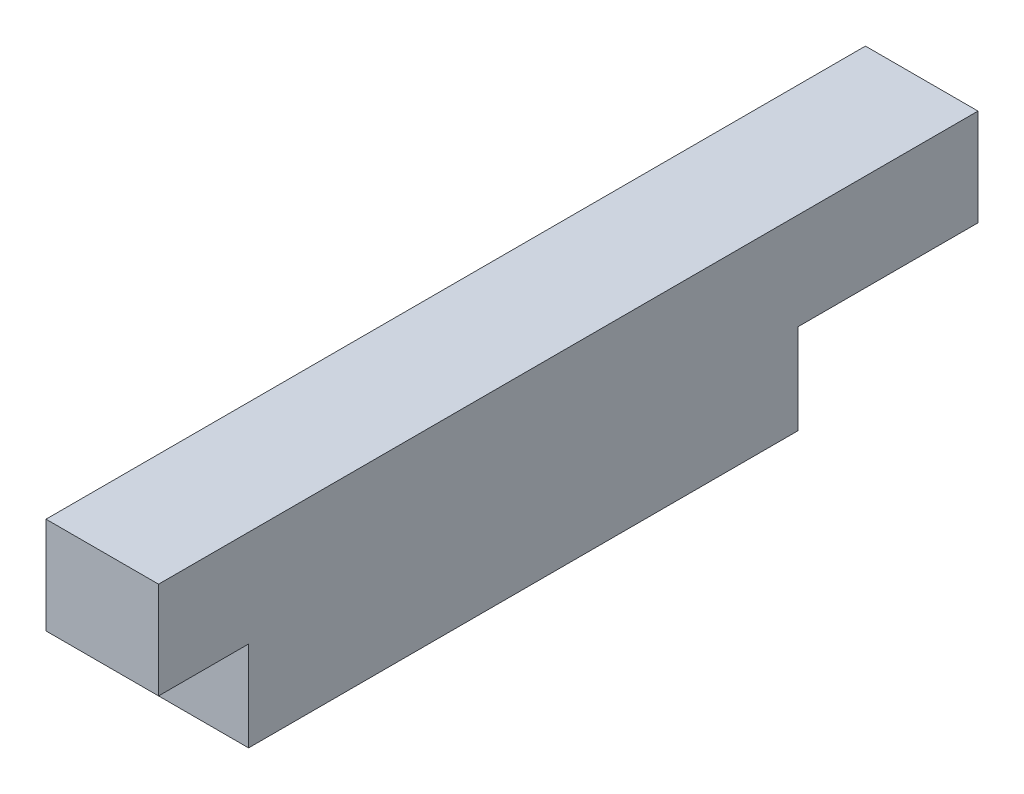
ISO-10303-21;
HEADER;
FILE_DESCRIPTION(('STEP AP214'),'2;1');
FILE_NAME('part.step','',(''),(''),'','','');
FILE_SCHEMA(('AUTOMOTIVE_DESIGN { 1 0 10303 214 1 1 1 1 }'));
ENDSEC;
DATA;
#1=APPLICATION_CONTEXT('core data for automotive mechanical design processes');
#2=APPLICATION_PROTOCOL_DEFINITION('international standard','automotive_design',2000,#1);
#3=PRODUCT_CONTEXT('',#1,'mechanical');
#4=PRODUCT('Part','Part','',(#3));
#5=PRODUCT_RELATED_PRODUCT_CATEGORY('part','',(#4));
#6=PRODUCT_DEFINITION_FORMATION('','',#4);
#7=PRODUCT_DEFINITION_CONTEXT('part definition',#1,'design');
#8=PRODUCT_DEFINITION('design','',#6,#7);
#9=PRODUCT_DEFINITION_SHAPE('','',#8);
#10=(LENGTH_UNIT() NAMED_UNIT(*) SI_UNIT(.MILLI.,.METRE.));
#11=(NAMED_UNIT(*) PLANE_ANGLE_UNIT() SI_UNIT($,.RADIAN.));
#12=(NAMED_UNIT(*) SI_UNIT($,.STERADIAN.) SOLID_ANGLE_UNIT());
#13=UNCERTAINTY_MEASURE_WITH_UNIT(LENGTH_MEASURE(1.E-05),#10,'distance_accuracy_value','');
#14=(GEOMETRIC_REPRESENTATION_CONTEXT(3) GLOBAL_UNCERTAINTY_ASSIGNED_CONTEXT((#13)) GLOBAL_UNIT_ASSIGNED_CONTEXT((#10,
#11,#12)) REPRESENTATION_CONTEXT('',''));
#15=CARTESIAN_POINT('',(0.,0.,0.));
#16=DIRECTION('',(0.,0.,1.));
#17=DIRECTION('',(1.,0.,0.));
#18=AXIS2_PLACEMENT_3D('',#15,#16,#17);
#19=CARTESIAN_POINT('',(5.,4.,-4.));
#20=DIRECTION('',(0.,1.,0.));
#21=DIRECTION('',(0.,0.,1.));
#22=AXIS2_PLACEMENT_3D('',#19,#20,#21);
#23=PLANE('',#22);
#24=DIRECTION('',(0.,0.,-1.));
#25=VECTOR('',#24,1.);
#26=CARTESIAN_POINT('',(0.,4.,-4.));
#27=LINE('',#26,#25);
#28=CARTESIAN_POINT('',(0.,4.,0.));
#29=VERTEX_POINT('',#28);
#30=CARTESIAN_POINT('',(0.,4.,-4.));
#31=VERTEX_POINT('',#30);
#32=EDGE_CURVE('E129',#29,#31,#27,.T.);
#33=ORIENTED_EDGE('',*,*,#32,.T.);
#34=DIRECTION('',(-1.,0.,0.));
#35=VECTOR('',#34,1.);
#36=CARTESIAN_POINT('',(5.,4.,-4.));
#37=LINE('',#36,#35);
#38=CARTESIAN_POINT('',(5.,4.,-4.));
#39=VERTEX_POINT('',#38);
#40=EDGE_CURVE('E11',#39,#31,#37,.T.);
#41=ORIENTED_EDGE('',*,*,#40,.F.);
#42=DIRECTION('',(0.,0.,-1.));
#43=VECTOR('',#42,1.);
#44=CARTESIAN_POINT('',(5.,4.,-4.));
#45=LINE('',#44,#43);
#46=CARTESIAN_POINT('',(5.,4.,0.));
#47=VERTEX_POINT('',#46);
#48=EDGE_CURVE('E144',#47,#39,#45,.T.);
#49=ORIENTED_EDGE('',*,*,#48,.F.);
#50=DIRECTION('',(-1.,0.,0.));
#51=VECTOR('',#50,1.);
#52=CARTESIAN_POINT('',(5.,4.,0.));
#53=LINE('',#52,#51);
#54=EDGE_CURVE('E125',#47,#29,#53,.T.);
#55=ORIENTED_EDGE('',*,*,#54,.T.);
#56=EDGE_LOOP('',(#33,#41,#49,#55));
#57=FACE_BOUND('',#56,.T.);
#58=ADVANCED_FACE('F33',(#57),#23,.F.);
#59=CARTESIAN_POINT('',(5.,0.,-4.));
#60=DIRECTION('',(0.,0.,-1.));
#61=DIRECTION('',(0.,1.,0.));
#62=AXIS2_PLACEMENT_3D('',#59,#60,#61);
#63=PLANE('',#62);
#64=DIRECTION('',(0.,-1.,0.));
#65=VECTOR('',#64,1.);
#66=CARTESIAN_POINT('',(0.,0.,-4.));
#67=LINE('',#66,#65);
#68=CARTESIAN_POINT('',(0.,0.,-4.));
#69=VERTEX_POINT('',#68);
#70=EDGE_CURVE('E132',#31,#69,#67,.T.);
#71=ORIENTED_EDGE('',*,*,#70,.T.);
#72=DIRECTION('',(-1.,0.,0.));
#73=VECTOR('',#72,1.);
#74=CARTESIAN_POINT('',(5.,0.,-4.));
#75=LINE('',#74,#73);
#76=CARTESIAN_POINT('',(5.,0.,-4.));
#77=VERTEX_POINT('',#76);
#78=EDGE_CURVE('E41',#77,#69,#75,.T.);
#79=ORIENTED_EDGE('',*,*,#78,.F.);
#80=DIRECTION('',(0.,-1.,0.));
#81=VECTOR('',#80,1.);
#82=CARTESIAN_POINT('',(5.,0.,-4.));
#83=LINE('',#82,#81);
#84=EDGE_CURVE('E92',#39,#77,#83,.T.);
#85=ORIENTED_EDGE('',*,*,#84,.F.);
#86=ORIENTED_EDGE('',*,*,#40,.T.);
#87=EDGE_LOOP('',(#71,#79,#85,#86));
#88=FACE_BOUND('',#87,.T.);
#89=ADVANCED_FACE('F193',(#88),#63,.F.);
#90=CARTESIAN_POINT('',(5.,0.,-28.4));
#91=DIRECTION('',(0.,1.,0.));
#92=DIRECTION('',(0.,0.,1.));
#93=AXIS2_PLACEMENT_3D('',#90,#91,#92);
#94=PLANE('',#93);
#95=CARTESIAN_POINT('',(2.5,0.,-9.));
#96=DIRECTION('',(0.,-1.,0.));
#97=DIRECTION('',(0.,0.,-1.));
#98=AXIS2_PLACEMENT_3D('',#95,#96,#97);
#99=CIRCLE('',#98,0.799999999999999);
#100=CARTESIAN_POINT('',(2.5,0.,-9.8));
#101=VERTEX_POINT('',#100);
#102=EDGE_CURVE('E185',#101,#101,#99,.T.);
#103=ORIENTED_EDGE('',*,*,#102,.F.);
#104=EDGE_LOOP('',(#103));
#105=FACE_BOUND('',#104,.T.);
#106=CARTESIAN_POINT('',(2.5,0.,-23.4));
#107=DIRECTION('',(0.,-1.,0.));
#108=DIRECTION('',(0.,0.,-1.));
#109=AXIS2_PLACEMENT_3D('',#106,#107,#108);
#110=CIRCLE('',#109,0.799999999999999);
#111=CARTESIAN_POINT('',(2.5,0.,-24.2));
#112=VERTEX_POINT('',#111);
#113=EDGE_CURVE('E179',#112,#112,#110,.T.);
#114=ORIENTED_EDGE('',*,*,#113,.F.);
#115=EDGE_LOOP('',(#114));
#116=FACE_BOUND('',#115,.T.);
#117=DIRECTION('',(0.,0.,-1.));
#118=VECTOR('',#117,1.);
#119=CARTESIAN_POINT('',(0.,0.,-28.4));
#120=LINE('',#119,#118);
#121=CARTESIAN_POINT('',(0.,0.,-28.4));
#122=VERTEX_POINT('',#121);
#123=EDGE_CURVE('E135',#69,#122,#120,.T.);
#124=ORIENTED_EDGE('',*,*,#123,.T.);
#125=DIRECTION('',(-1.,0.,0.));
#126=VECTOR('',#125,1.);
#127=CARTESIAN_POINT('',(5.,0.,-28.4));
#128=LINE('',#127,#126);
#129=CARTESIAN_POINT('',(5.,0.,-28.4));
#130=VERTEX_POINT('',#129);
#131=EDGE_CURVE('E151',#130,#122,#128,.T.);
#132=ORIENTED_EDGE('',*,*,#131,.F.);
#133=DIRECTION('',(0.,0.,-1.));
#134=VECTOR('',#133,1.);
#135=CARTESIAN_POINT('',(5.,0.,-28.4));
#136=LINE('',#135,#134);
#137=EDGE_CURVE('E159',#77,#130,#136,.T.);
#138=ORIENTED_EDGE('',*,*,#137,.F.);
#139=ORIENTED_EDGE('',*,*,#78,.T.);
#140=EDGE_LOOP('',(#124,#132,#138,#139));
#141=FACE_BOUND('',#140,.T.);
#142=ADVANCED_FACE('F157',(#105,#116,#141),#94,.F.);
#143=CARTESIAN_POINT('',(5.,4.,-28.4));
#144=DIRECTION('',(0.,0.,1.));
#145=DIRECTION('',(1.,0.,0.));
#146=AXIS2_PLACEMENT_3D('',#143,#144,#145);
#147=PLANE('',#146);
#148=DIRECTION('',(0.,1.,0.));
#149=VECTOR('',#148,1.);
#150=CARTESIAN_POINT('',(0.,4.,-28.4));
#151=LINE('',#150,#149);
#152=CARTESIAN_POINT('',(0.,4.,-28.4));
#153=VERTEX_POINT('',#152);
#154=EDGE_CURVE('E137',#122,#153,#151,.T.);
#155=ORIENTED_EDGE('',*,*,#154,.T.);
#156=DIRECTION('',(-1.,0.,0.));
#157=VECTOR('',#156,1.);
#158=CARTESIAN_POINT('',(5.,4.,-28.4));
#159=LINE('',#158,#157);
#160=CARTESIAN_POINT('',(5.,4.,-28.4));
#161=VERTEX_POINT('',#160);
#162=EDGE_CURVE('E148',#161,#153,#159,.T.);
#163=ORIENTED_EDGE('',*,*,#162,.F.);
#164=DIRECTION('',(0.,1.,0.));
#165=VECTOR('',#164,1.);
#166=CARTESIAN_POINT('',(5.,4.,-28.4));
#167=LINE('',#166,#165);
#168=EDGE_CURVE('E171',#130,#161,#167,.T.);
#169=ORIENTED_EDGE('',*,*,#168,.F.);
#170=ORIENTED_EDGE('',*,*,#131,.T.);
#171=EDGE_LOOP('',(#155,#163,#169,#170));
#172=FACE_BOUND('',#171,.T.);
#173=ADVANCED_FACE('F167',(#172),#147,.F.);
#174=CARTESIAN_POINT('',(5.,4.,-36.4));
#175=DIRECTION('',(0.,1.,0.));
#176=DIRECTION('',(0.,0.,1.));
#177=AXIS2_PLACEMENT_3D('',#174,#175,#176);
#178=PLANE('',#177);
#179=DIRECTION('',(0.,0.,-1.));
#180=VECTOR('',#179,1.);
#181=CARTESIAN_POINT('',(0.,4.,-36.4));
#182=LINE('',#181,#180);
#183=CARTESIAN_POINT('',(0.,4.,-36.4));
#184=VERTEX_POINT('',#183);
#185=EDGE_CURVE('E139',#153,#184,#182,.T.);
#186=ORIENTED_EDGE('',*,*,#185,.T.);
#187=DIRECTION('',(-1.,0.,0.));
#188=VECTOR('',#187,1.);
#189=CARTESIAN_POINT('',(5.,4.,-36.4));
#190=LINE('',#189,#188);
#191=CARTESIAN_POINT('',(5.,4.,-36.4));
#192=VERTEX_POINT('',#191);
#193=EDGE_CURVE('E120',#192,#184,#190,.T.);
#194=ORIENTED_EDGE('',*,*,#193,.F.);
#195=DIRECTION('',(0.,0.,-1.));
#196=VECTOR('',#195,1.);
#197=CARTESIAN_POINT('',(5.,4.,-36.4));
#198=LINE('',#197,#196);
#199=EDGE_CURVE('E111',#161,#192,#198,.T.);
#200=ORIENTED_EDGE('',*,*,#199,.F.);
#201=ORIENTED_EDGE('',*,*,#162,.T.);
#202=EDGE_LOOP('',(#186,#194,#200,#201));
#203=FACE_BOUND('',#202,.T.);
#204=ADVANCED_FACE('F170',(#203),#178,.F.);
#205=CARTESIAN_POINT('',(5.,8.29999999999999,-36.4));
#206=DIRECTION('',(0.,0.,1.));
#207=DIRECTION('',(1.,0.,0.));
#208=AXIS2_PLACEMENT_3D('',#205,#206,#207);
#209=PLANE('',#208);
#210=DIRECTION('',(0.,1.,0.));
#211=VECTOR('',#210,1.);
#212=CARTESIAN_POINT('',(0.,8.29999999999999,-36.4));
#213=LINE('',#212,#211);
#214=CARTESIAN_POINT('',(0.,8.29999999999999,-36.4));
#215=VERTEX_POINT('',#214);
#216=EDGE_CURVE('E119',#184,#215,#213,.T.);
#217=ORIENTED_EDGE('',*,*,#216,.T.);
#218=DIRECTION('',(-1.,0.,0.));
#219=VECTOR('',#218,1.);
#220=CARTESIAN_POINT('',(5.,8.29999999999999,-36.4));
#221=LINE('',#220,#219);
#222=CARTESIAN_POINT('',(5.,8.29999999999999,-36.4));
#223=VERTEX_POINT('',#222);
#224=EDGE_CURVE('E116',#223,#215,#221,.T.);
#225=ORIENTED_EDGE('',*,*,#224,.F.);
#226=DIRECTION('',(0.,1.,0.));
#227=VECTOR('',#226,1.);
#228=CARTESIAN_POINT('',(5.,8.29999999999999,-36.4));
#229=LINE('',#228,#227);
#230=EDGE_CURVE('E105',#192,#223,#229,.T.);
#231=ORIENTED_EDGE('',*,*,#230,.F.);
#232=ORIENTED_EDGE('',*,*,#193,.T.);
#233=EDGE_LOOP('',(#217,#225,#231,#232));
#234=FACE_BOUND('',#233,.T.);
#235=ADVANCED_FACE('F117',(#234),#209,.F.);
#236=CARTESIAN_POINT('',(5.,8.29999999999999,0.));
#237=DIRECTION('',(0.,-1.,0.));
#238=DIRECTION('',(0.,0.,-1.));
#239=AXIS2_PLACEMENT_3D('',#236,#237,#238);
#240=PLANE('',#239);
#241=DIRECTION('',(0.,0.,1.));
#242=VECTOR('',#241,1.);
#243=CARTESIAN_POINT('',(0.,8.29999999999999,0.));
#244=LINE('',#243,#242);
#245=CARTESIAN_POINT('',(0.,8.29999999999999,0.));
#246=VERTEX_POINT('',#245);
#247=EDGE_CURVE('E78',#215,#246,#244,.T.);
#248=ORIENTED_EDGE('',*,*,#247,.T.);
#249=DIRECTION('',(-1.,0.,0.));
#250=VECTOR('',#249,1.);
#251=CARTESIAN_POINT('',(5.,8.29999999999999,0.));
#252=LINE('',#251,#250);
#253=CARTESIAN_POINT('',(5.,8.29999999999999,0.));
#254=VERTEX_POINT('',#253);
#255=EDGE_CURVE('E121',#254,#246,#252,.T.);
#256=ORIENTED_EDGE('',*,*,#255,.F.);
#257=DIRECTION('',(0.,0.,1.));
#258=VECTOR('',#257,1.);
#259=CARTESIAN_POINT('',(5.,8.29999999999999,0.));
#260=LINE('',#259,#258);
#261=EDGE_CURVE('E109',#223,#254,#260,.T.);
#262=ORIENTED_EDGE('',*,*,#261,.F.);
#263=ORIENTED_EDGE('',*,*,#224,.T.);
#264=EDGE_LOOP('',(#248,#256,#262,#263));
#265=FACE_BOUND('',#264,.T.);
#266=ADVANCED_FACE('F123',(#265),#240,.F.);
#267=CARTESIAN_POINT('',(5.,4.,0.));
#268=DIRECTION('',(0.,0.,-1.));
#269=DIRECTION('',(0.,1.,0.));
#270=AXIS2_PLACEMENT_3D('',#267,#268,#269);
#271=PLANE('',#270);
#272=DIRECTION('',(0.,-1.,0.));
#273=VECTOR('',#272,1.);
#274=CARTESIAN_POINT('',(0.,4.,0.));
#275=LINE('',#274,#273);
#276=EDGE_CURVE('E84',#246,#29,#275,.T.);
#277=ORIENTED_EDGE('',*,*,#276,.T.);
#278=ORIENTED_EDGE('',*,*,#54,.F.);
#279=DIRECTION('',(0.,-1.,0.));
#280=VECTOR('',#279,1.);
#281=CARTESIAN_POINT('',(5.,4.,0.));
#282=LINE('',#281,#280);
#283=EDGE_CURVE('E49',#254,#47,#282,.T.);
#284=ORIENTED_EDGE('',*,*,#283,.F.);
#285=ORIENTED_EDGE('',*,*,#255,.T.);
#286=EDGE_LOOP('',(#277,#278,#284,#285));
#287=FACE_BOUND('',#286,.T.);
#288=ADVANCED_FACE('F219',(#287),#271,.F.);
#289=CARTESIAN_POINT('',(5.,0.,0.));
#290=DIRECTION('',(-1.,0.,0.));
#291=DIRECTION('',(0.,0.,1.));
#292=AXIS2_PLACEMENT_3D('',#289,#290,#291);
#293=PLANE('',#292);
#294=ORIENTED_EDGE('',*,*,#48,.T.);
#295=ORIENTED_EDGE('',*,*,#84,.T.);
#296=ORIENTED_EDGE('',*,*,#137,.T.);
#297=ORIENTED_EDGE('',*,*,#168,.T.);
#298=ORIENTED_EDGE('',*,*,#199,.T.);
#299=ORIENTED_EDGE('',*,*,#230,.T.);
#300=ORIENTED_EDGE('',*,*,#261,.T.);
#301=ORIENTED_EDGE('',*,*,#283,.T.);
#302=EDGE_LOOP('',(#294,#295,#296,#297,#298,#299,#300,#301));
#303=FACE_BOUND('',#302,.T.);
#304=ADVANCED_FACE('F107',(#303),#293,.F.);
#305=CARTESIAN_POINT('',(0.,0.,0.));
#306=DIRECTION('',(-1.,0.,0.));
#307=DIRECTION('',(0.,0.,1.));
#308=AXIS2_PLACEMENT_3D('',#305,#306,#307);
#309=PLANE('',#308);
#310=ORIENTED_EDGE('',*,*,#32,.F.);
#311=ORIENTED_EDGE('',*,*,#276,.F.);
#312=ORIENTED_EDGE('',*,*,#247,.F.);
#313=ORIENTED_EDGE('',*,*,#216,.F.);
#314=ORIENTED_EDGE('',*,*,#185,.F.);
#315=ORIENTED_EDGE('',*,*,#154,.F.);
#316=ORIENTED_EDGE('',*,*,#123,.F.);
#317=ORIENTED_EDGE('',*,*,#70,.F.);
#318=EDGE_LOOP('',(#310,#311,#312,#313,#314,#315,#316,#317));
#319=FACE_BOUND('',#318,.T.);
#320=ADVANCED_FACE('F163',(#319),#309,.T.);
#321=CARTESIAN_POINT('',(2.5,5.,-23.4));
#322=DIRECTION('',(0.,1.,0.));
#323=DIRECTION('',(0.,0.,1.));
#324=AXIS2_PLACEMENT_3D('',#321,#322,#323);
#325=PLANE('',#324);
#326=CARTESIAN_POINT('',(2.5,5.,-23.4));
#327=DIRECTION('',(0.,-1.,0.));
#328=DIRECTION('',(0.,0.,-1.));
#329=AXIS2_PLACEMENT_3D('',#326,#327,#328);
#330=CIRCLE('',#329,0.799999999999998);
#331=CARTESIAN_POINT('',(2.5,5.,-24.2));
#332=VERTEX_POINT('',#331);
#333=EDGE_CURVE('E133',#332,#332,#330,.T.);
#334=ORIENTED_EDGE('',*,*,#333,.T.);
#335=EDGE_LOOP('',(#334));
#336=FACE_BOUND('',#335,.T.);
#337=ADVANCED_FACE('F200',(#336),#325,.F.);
#338=CARTESIAN_POINT('',(2.5,0.,-23.4));
#339=DIRECTION('',(0.,-1.,0.));
#340=DIRECTION('',(0.,0.,-1.));
#341=AXIS2_PLACEMENT_3D('',#338,#339,#340);
#342=CYLINDRICAL_SURFACE('',#341,0.799999999999999);
#343=ORIENTED_EDGE('',*,*,#333,.F.);
#344=EDGE_LOOP('',(#343));
#345=FACE_BOUND('',#344,.T.);
#346=ORIENTED_EDGE('',*,*,#113,.T.);
#347=EDGE_LOOP('',(#346));
#348=FACE_BOUND('',#347,.T.);
#349=ADVANCED_FACE('F197',(#345,#348),#342,.F.);
#350=CARTESIAN_POINT('',(2.5,5.,-9.));
#351=DIRECTION('',(0.,1.,0.));
#352=DIRECTION('',(0.,0.,1.));
#353=AXIS2_PLACEMENT_3D('',#350,#351,#352);
#354=PLANE('',#353);
#355=CARTESIAN_POINT('',(2.5,5.,-9.));
#356=DIRECTION('',(0.,-1.,0.));
#357=DIRECTION('',(0.,0.,-1.));
#358=AXIS2_PLACEMENT_3D('',#355,#356,#357);
#359=CIRCLE('',#358,0.799999999999998);
#360=CARTESIAN_POINT('',(2.5,5.,-9.8));
#361=VERTEX_POINT('',#360);
#362=EDGE_CURVE('E182',#361,#361,#359,.T.);
#363=ORIENTED_EDGE('',*,*,#362,.T.);
#364=EDGE_LOOP('',(#363));
#365=FACE_BOUND('',#364,.T.);
#366=ADVANCED_FACE('F199',(#365),#354,.F.);
#367=CARTESIAN_POINT('',(2.5,0.,-9.));
#368=DIRECTION('',(0.,-1.,0.));
#369=DIRECTION('',(0.,0.,-1.));
#370=AXIS2_PLACEMENT_3D('',#367,#368,#369);
#371=CYLINDRICAL_SURFACE('',#370,0.799999999999999);
#372=ORIENTED_EDGE('',*,*,#362,.F.);
#373=EDGE_LOOP('',(#372));
#374=FACE_BOUND('',#373,.T.);
#375=ORIENTED_EDGE('',*,*,#102,.T.);
#376=EDGE_LOOP('',(#375));
#377=FACE_BOUND('',#376,.T.);
#378=ADVANCED_FACE('F189',(#374,#377),#371,.F.);
#379=CLOSED_SHELL('',(#58,#89,#142,#173,#204,#235,#266,#288,#304,#320,#337,#349,#366,#378));
#380=MANIFOLD_SOLID_BREP('B2',#379);
#381=ADVANCED_BREP_SHAPE_REPRESENTATION('',(#18,#380),#14);
#382=SHAPE_DEFINITION_REPRESENTATION(#9,#381);
ENDSEC;
END-ISO-10303-21;
